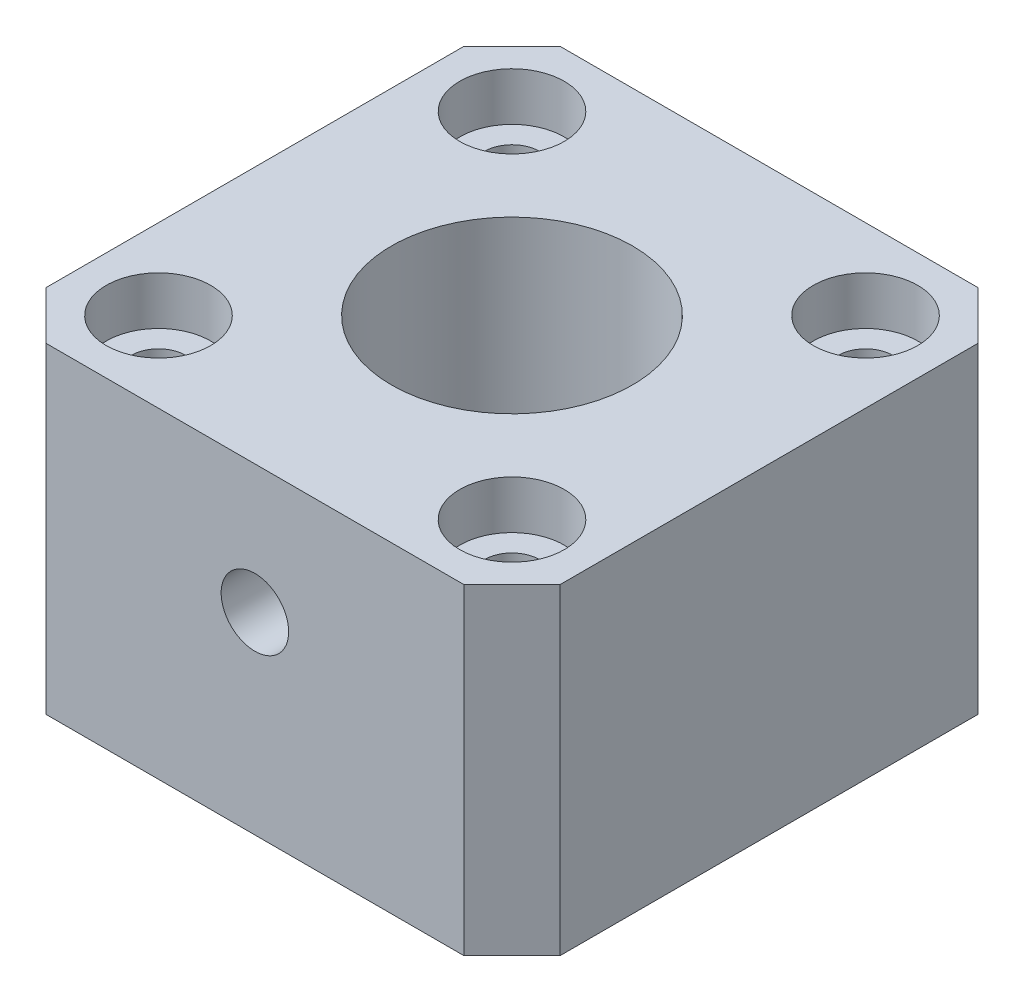
ISO-10303-21;
HEADER;
FILE_DESCRIPTION(('STEP AP214'),'2;1');
FILE_NAME('part.step','',(''),(''),'','','');
FILE_SCHEMA(('AUTOMOTIVE_DESIGN { 1 0 10303 214 1 1 1 1 }'));
ENDSEC;
DATA;
#1=APPLICATION_CONTEXT('core data for automotive mechanical design processes');
#2=APPLICATION_PROTOCOL_DEFINITION('international standard','automotive_design',2000,#1);
#3=PRODUCT_CONTEXT('',#1,'mechanical');
#4=PRODUCT('Part','Part','',(#3));
#5=PRODUCT_RELATED_PRODUCT_CATEGORY('part','',(#4));
#6=PRODUCT_DEFINITION_FORMATION('','',#4);
#7=PRODUCT_DEFINITION_CONTEXT('part definition',#1,'design');
#8=PRODUCT_DEFINITION('design','',#6,#7);
#9=PRODUCT_DEFINITION_SHAPE('','',#8);
#10=(LENGTH_UNIT() NAMED_UNIT(*) SI_UNIT(.MILLI.,.METRE.));
#11=(NAMED_UNIT(*) PLANE_ANGLE_UNIT() SI_UNIT($,.RADIAN.));
#12=(NAMED_UNIT(*) SI_UNIT($,.STERADIAN.) SOLID_ANGLE_UNIT());
#13=UNCERTAINTY_MEASURE_WITH_UNIT(LENGTH_MEASURE(1.E-05),#10,'distance_accuracy_value','');
#14=(GEOMETRIC_REPRESENTATION_CONTEXT(3) GLOBAL_UNCERTAINTY_ASSIGNED_CONTEXT((#13)) GLOBAL_UNIT_ASSIGNED_CONTEXT((#10,
#11,#12)) REPRESENTATION_CONTEXT('',''));
#15=CARTESIAN_POINT('',(0.,0.,0.));
#16=DIRECTION('',(0.,0.,1.));
#17=DIRECTION('',(1.,0.,0.));
#18=AXIS2_PLACEMENT_3D('',#15,#16,#17);
#19=CARTESIAN_POINT('',(0.,20.,0.));
#20=DIRECTION('',(0.,1.,0.));
#21=DIRECTION('',(0.,0.,1.));
#22=AXIS2_PLACEMENT_3D('',#19,#20,#21);
#23=PLANE('',#22);
#24=CARTESIAN_POINT('',(-11.,20.,-11.));
#25=DIRECTION('',(0.,1.,0.));
#26=DIRECTION('',(0.,0.,1.));
#27=AXIS2_PLACEMENT_3D('',#24,#25,#26);
#28=CIRCLE('',#27,3.25);
#29=CARTESIAN_POINT('',(-11.,20.,-7.75));
#30=VERTEX_POINT('',#29);
#31=EDGE_CURVE('E248',#30,#30,#28,.T.);
#32=ORIENTED_EDGE('',*,*,#31,.F.);
#33=EDGE_LOOP('',(#32));
#34=FACE_BOUND('',#33,.T.);
#35=CARTESIAN_POINT('',(11.,20.,-11.));
#36=DIRECTION('',(0.,1.,0.));
#37=DIRECTION('',(0.,0.,1.));
#38=AXIS2_PLACEMENT_3D('',#35,#36,#37);
#39=CIRCLE('',#38,3.25);
#40=CARTESIAN_POINT('',(11.,20.,-7.75));
#41=VERTEX_POINT('',#40);
#42=EDGE_CURVE('E236',#41,#41,#39,.T.);
#43=ORIENTED_EDGE('',*,*,#42,.F.);
#44=EDGE_LOOP('',(#43));
#45=FACE_BOUND('',#44,.T.);
#46=CARTESIAN_POINT('',(11.,20.,11.));
#47=DIRECTION('',(0.,1.,0.));
#48=DIRECTION('',(0.,0.,1.));
#49=AXIS2_PLACEMENT_3D('',#46,#47,#48);
#50=CIRCLE('',#49,3.25);
#51=CARTESIAN_POINT('',(11.,20.,14.25));
#52=VERTEX_POINT('',#51);
#53=EDGE_CURVE('E224',#52,#52,#50,.T.);
#54=ORIENTED_EDGE('',*,*,#53,.F.);
#55=EDGE_LOOP('',(#54));
#56=FACE_BOUND('',#55,.T.);
#57=CARTESIAN_POINT('',(-11.,20.,11.));
#58=DIRECTION('',(0.,1.,0.));
#59=DIRECTION('',(0.,0.,1.));
#60=AXIS2_PLACEMENT_3D('',#57,#58,#59);
#61=CIRCLE('',#60,3.25);
#62=CARTESIAN_POINT('',(-11.,20.,14.25));
#63=VERTEX_POINT('',#62);
#64=EDGE_CURVE('E212',#63,#63,#61,.T.);
#65=ORIENTED_EDGE('',*,*,#64,.F.);
#66=EDGE_LOOP('',(#65));
#67=FACE_BOUND('',#66,.T.);
#68=DIRECTION('',(1.,0.,0.));
#69=VECTOR('',#68,1.);
#70=CARTESIAN_POINT('',(15.9999999999999,20.,15.9999999999999));
#71=LINE('',#70,#69);
#72=CARTESIAN_POINT('',(-12.9999999999999,20.,15.9999999999999));
#73=VERTEX_POINT('',#72);
#74=CARTESIAN_POINT('',(12.9999999999999,20.,15.9999999999999));
#75=VERTEX_POINT('',#74);
#76=EDGE_CURVE('E187',#73,#75,#71,.T.);
#77=ORIENTED_EDGE('',*,*,#76,.T.);
#78=DIRECTION('',(-0.707106781186548,0.,0.707106781186547));
#79=VECTOR('',#78,1.);
#80=CARTESIAN_POINT('',(14.4999999999999,20.,14.5));
#81=LINE('',#80,#79);
#82=CARTESIAN_POINT('',(15.9999999999999,20.,12.9999999999999));
#83=VERTEX_POINT('',#82);
#84=EDGE_CURVE('E167',#75,#83,#81,.F.);
#85=ORIENTED_EDGE('',*,*,#84,.T.);
#86=DIRECTION('',(0.,0.,-1.));
#87=VECTOR('',#86,1.);
#88=CARTESIAN_POINT('',(15.9999999999999,20.,15.9999999999999));
#89=LINE('',#88,#87);
#90=CARTESIAN_POINT('',(15.9999999999999,20.,-12.9999999999999));
#91=VERTEX_POINT('',#90);
#92=EDGE_CURVE('E137',#83,#91,#89,.T.);
#93=ORIENTED_EDGE('',*,*,#92,.T.);
#94=DIRECTION('',(0.707106781186547,0.,0.707106781186548));
#95=VECTOR('',#94,1.);
#96=CARTESIAN_POINT('',(14.5,20.,-14.4999999999999));
#97=LINE('',#96,#95);
#98=CARTESIAN_POINT('',(12.9999999999999,20.,-15.9999999999999));
#99=VERTEX_POINT('',#98);
#100=EDGE_CURVE('E73',#91,#99,#97,.F.);
#101=ORIENTED_EDGE('',*,*,#100,.T.);
#102=DIRECTION('',(-1.,0.,0.));
#103=VECTOR('',#102,1.);
#104=CARTESIAN_POINT('',(15.9999999999999,20.,-15.9999999999999));
#105=LINE('',#104,#103);
#106=CARTESIAN_POINT('',(-12.9999999999999,20.,-15.9999999999999));
#107=VERTEX_POINT('',#106);
#108=EDGE_CURVE('E154',#99,#107,#105,.T.);
#109=ORIENTED_EDGE('',*,*,#108,.T.);
#110=DIRECTION('',(0.707106781186548,0.,-0.707106781186547));
#111=VECTOR('',#110,1.);
#112=CARTESIAN_POINT('',(-14.4999999999999,20.,-14.5));
#113=LINE('',#112,#111);
#114=CARTESIAN_POINT('',(-15.9999999999999,20.,-12.9999999999999));
#115=VERTEX_POINT('',#114);
#116=EDGE_CURVE('E162',#107,#115,#113,.F.);
#117=ORIENTED_EDGE('',*,*,#116,.T.);
#118=DIRECTION('',(0.,0.,1.));
#119=VECTOR('',#118,1.);
#120=CARTESIAN_POINT('',(-15.9999999999999,20.,15.9999999999999));
#121=LINE('',#120,#119);
#122=CARTESIAN_POINT('',(-15.9999999999999,20.,12.9999999999999));
#123=VERTEX_POINT('',#122);
#124=EDGE_CURVE('E148',#115,#123,#121,.T.);
#125=ORIENTED_EDGE('',*,*,#124,.T.);
#126=DIRECTION('',(-0.707106781186547,0.,-0.707106781186548));
#127=VECTOR('',#126,1.);
#128=CARTESIAN_POINT('',(-14.5,20.,14.4999999999999));
#129=LINE('',#128,#127);
#130=EDGE_CURVE('E165',#123,#73,#129,.F.);
#131=ORIENTED_EDGE('',*,*,#130,.T.);
#132=EDGE_LOOP('',(#77,#85,#93,#101,#109,#117,#125,#131));
#133=FACE_BOUND('',#132,.T.);
#134=CARTESIAN_POINT('',(0.,20.,0.));
#135=DIRECTION('',(0.,1.,0.));
#136=DIRECTION('',(0.,0.,1.));
#137=AXIS2_PLACEMENT_3D('',#134,#135,#136);
#138=CIRCLE('',#137,7.5);
#139=CARTESIAN_POINT('',(0.,20.,7.5));
#140=VERTEX_POINT('',#139);
#141=EDGE_CURVE('E193',#140,#140,#138,.T.);
#142=ORIENTED_EDGE('',*,*,#141,.F.);
#143=EDGE_LOOP('',(#142));
#144=FACE_BOUND('',#143,.T.);
#145=ADVANCED_FACE('F51',(#34,#45,#56,#67,#133,#144),#23,.T.);
#146=CARTESIAN_POINT('',(0.,0.,0.));
#147=DIRECTION('',(0.,1.,0.));
#148=DIRECTION('',(0.,0.,1.));
#149=AXIS2_PLACEMENT_3D('',#146,#147,#148);
#150=PLANE('',#149);
#151=CARTESIAN_POINT('',(-11.,0.,-11.));
#152=DIRECTION('',(0.,1.,0.));
#153=DIRECTION('',(0.,0.,1.));
#154=AXIS2_PLACEMENT_3D('',#151,#152,#153);
#155=CIRCLE('',#154,1.69999999999999);
#156=CARTESIAN_POINT('',(-11.,0.,-9.30000000000001));
#157=VERTEX_POINT('',#156);
#158=EDGE_CURVE('E239',#157,#157,#155,.T.);
#159=ORIENTED_EDGE('',*,*,#158,.T.);
#160=EDGE_LOOP('',(#159));
#161=FACE_BOUND('',#160,.T.);
#162=CARTESIAN_POINT('',(11.,0.,-11.));
#163=DIRECTION('',(0.,1.,0.));
#164=DIRECTION('',(0.,0.,1.));
#165=AXIS2_PLACEMENT_3D('',#162,#163,#164);
#166=CIRCLE('',#165,1.69999999999999);
#167=CARTESIAN_POINT('',(11.,0.,-9.3));
#168=VERTEX_POINT('',#167);
#169=EDGE_CURVE('E227',#168,#168,#166,.T.);
#170=ORIENTED_EDGE('',*,*,#169,.T.);
#171=EDGE_LOOP('',(#170));
#172=FACE_BOUND('',#171,.T.);
#173=CARTESIAN_POINT('',(11.,0.,11.));
#174=DIRECTION('',(0.,1.,0.));
#175=DIRECTION('',(0.,0.,1.));
#176=AXIS2_PLACEMENT_3D('',#173,#174,#175);
#177=CIRCLE('',#176,1.69999999999999);
#178=CARTESIAN_POINT('',(11.,0.,12.7));
#179=VERTEX_POINT('',#178);
#180=EDGE_CURVE('E215',#179,#179,#177,.T.);
#181=ORIENTED_EDGE('',*,*,#180,.T.);
#182=EDGE_LOOP('',(#181));
#183=FACE_BOUND('',#182,.T.);
#184=CARTESIAN_POINT('',(-11.,0.,11.));
#185=DIRECTION('',(0.,1.,0.));
#186=DIRECTION('',(0.,0.,1.));
#187=AXIS2_PLACEMENT_3D('',#184,#185,#186);
#188=CIRCLE('',#187,1.69999999999999);
#189=CARTESIAN_POINT('',(-11.,0.,12.7));
#190=VERTEX_POINT('',#189);
#191=EDGE_CURVE('E202',#190,#190,#188,.T.);
#192=ORIENTED_EDGE('',*,*,#191,.T.);
#193=EDGE_LOOP('',(#192));
#194=FACE_BOUND('',#193,.T.);
#195=DIRECTION('',(0.,0.,-1.));
#196=VECTOR('',#195,1.);
#197=CARTESIAN_POINT('',(15.9999999999999,0.,15.9999999999999));
#198=LINE('',#197,#196);
#199=CARTESIAN_POINT('',(15.9999999999999,0.,12.9999999999999));
#200=VERTEX_POINT('',#199);
#201=CARTESIAN_POINT('',(15.9999999999999,0.,-12.9999999999999));
#202=VERTEX_POINT('',#201);
#203=EDGE_CURVE('E135',#200,#202,#198,.T.);
#204=ORIENTED_EDGE('',*,*,#203,.F.);
#205=DIRECTION('',(0.707106781186548,0.,-0.707106781186547));
#206=VECTOR('',#205,1.);
#207=CARTESIAN_POINT('',(15.9999999999999,0.,12.9999999999999));
#208=LINE('',#207,#206);
#209=CARTESIAN_POINT('',(12.9999999999999,0.,15.9999999999999));
#210=VERTEX_POINT('',#209);
#211=EDGE_CURVE('E118',#200,#210,#208,.F.);
#212=ORIENTED_EDGE('',*,*,#211,.T.);
#213=DIRECTION('',(1.,0.,0.));
#214=VECTOR('',#213,1.);
#215=CARTESIAN_POINT('',(15.9999999999999,0.,15.9999999999999));
#216=LINE('',#215,#214);
#217=CARTESIAN_POINT('',(-12.9999999999999,0.,15.9999999999999));
#218=VERTEX_POINT('',#217);
#219=EDGE_CURVE('E146',#218,#210,#216,.T.);
#220=ORIENTED_EDGE('',*,*,#219,.F.);
#221=DIRECTION('',(0.707106781186547,0.,0.707106781186548));
#222=VECTOR('',#221,1.);
#223=CARTESIAN_POINT('',(-12.9999999999999,0.,15.9999999999999));
#224=LINE('',#223,#222);
#225=CARTESIAN_POINT('',(-15.9999999999999,0.,12.9999999999999));
#226=VERTEX_POINT('',#225);
#227=EDGE_CURVE('E129',#218,#226,#224,.F.);
#228=ORIENTED_EDGE('',*,*,#227,.T.);
#229=DIRECTION('',(0.,0.,1.));
#230=VECTOR('',#229,1.);
#231=CARTESIAN_POINT('',(-15.9999999999999,0.,15.9999999999999));
#232=LINE('',#231,#230);
#233=CARTESIAN_POINT('',(-15.9999999999999,0.,-12.9999999999999));
#234=VERTEX_POINT('',#233);
#235=EDGE_CURVE('E150',#234,#226,#232,.T.);
#236=ORIENTED_EDGE('',*,*,#235,.F.);
#237=DIRECTION('',(-0.707106781186548,0.,0.707106781186547));
#238=VECTOR('',#237,1.);
#239=CARTESIAN_POINT('',(-15.9999999999999,0.,-12.9999999999999));
#240=LINE('',#239,#238);
#241=CARTESIAN_POINT('',(-12.9999999999999,0.,-15.9999999999999));
#242=VERTEX_POINT('',#241);
#243=EDGE_CURVE('E138',#234,#242,#240,.F.);
#244=ORIENTED_EDGE('',*,*,#243,.T.);
#245=DIRECTION('',(-1.,0.,0.));
#246=VECTOR('',#245,1.);
#247=CARTESIAN_POINT('',(15.9999999999999,0.,-15.9999999999999));
#248=LINE('',#247,#246);
#249=CARTESIAN_POINT('',(12.9999999999999,0.,-15.9999999999999));
#250=VERTEX_POINT('',#249);
#251=EDGE_CURVE('E145',#250,#242,#248,.T.);
#252=ORIENTED_EDGE('',*,*,#251,.F.);
#253=DIRECTION('',(-0.707106781186547,0.,-0.707106781186548));
#254=VECTOR('',#253,1.);
#255=CARTESIAN_POINT('',(12.9999999999999,0.,-15.9999999999999));
#256=LINE('',#255,#254);
#257=EDGE_CURVE('E144',#250,#202,#256,.F.);
#258=ORIENTED_EDGE('',*,*,#257,.T.);
#259=EDGE_LOOP('',(#204,#212,#220,#228,#236,#244,#252,#258));
#260=FACE_BOUND('',#259,.T.);
#261=CARTESIAN_POINT('',(0.,0.,0.));
#262=DIRECTION('',(0.,1.,0.));
#263=DIRECTION('',(0.,0.,1.));
#264=AXIS2_PLACEMENT_3D('',#261,#262,#263);
#265=CIRCLE('',#264,7.5);
#266=CARTESIAN_POINT('',(0.,0.,7.5));
#267=VERTEX_POINT('',#266);
#268=EDGE_CURVE('E195',#267,#267,#265,.T.);
#269=ORIENTED_EDGE('',*,*,#268,.T.);
#270=EDGE_LOOP('',(#269));
#271=FACE_BOUND('',#270,.T.);
#272=ADVANCED_FACE('F141',(#161,#172,#183,#194,#260,#271),#150,.F.);
#273=CARTESIAN_POINT('',(-15.9999999999999,20.,15.9999999999999));
#274=DIRECTION('',(1.,0.,0.));
#275=DIRECTION('',(0.,0.,-1.));
#276=AXIS2_PLACEMENT_3D('',#273,#274,#275);
#277=PLANE('',#276);
#278=ORIENTED_EDGE('',*,*,#235,.T.);
#279=DIRECTION('',(0.,1.,0.));
#280=VECTOR('',#279,1.);
#281=CARTESIAN_POINT('',(-15.9999999999999,20.,12.9999999999999));
#282=LINE('',#281,#280);
#283=EDGE_CURVE('E172',#226,#123,#282,.T.);
#284=ORIENTED_EDGE('',*,*,#283,.T.);
#285=ORIENTED_EDGE('',*,*,#124,.F.);
#286=DIRECTION('',(0.,-1.,0.));
#287=VECTOR('',#286,1.);
#288=CARTESIAN_POINT('',(-15.9999999999999,20.,-12.9999999999999));
#289=LINE('',#288,#287);
#290=EDGE_CURVE('E169',#115,#234,#289,.T.);
#291=ORIENTED_EDGE('',*,*,#290,.T.);
#292=EDGE_LOOP('',(#278,#284,#285,#291));
#293=FACE_BOUND('',#292,.T.);
#294=ADVANCED_FACE('F178',(#293),#277,.F.);
#295=CARTESIAN_POINT('',(15.9999999999999,20.,15.9999999999999));
#296=DIRECTION('',(0.,0.,-1.));
#297=DIRECTION('',(-1.,0.,0.));
#298=AXIS2_PLACEMENT_3D('',#295,#296,#297);
#299=PLANE('',#298);
#300=CARTESIAN_POINT('',(0.,12.,15.9999999999999));
#301=DIRECTION('',(0.,0.,1.));
#302=DIRECTION('',(1.,0.,0.));
#303=AXIS2_PLACEMENT_3D('',#300,#301,#302);
#304=CIRCLE('',#303,2.1);
#305=CARTESIAN_POINT('',(2.1,12.,15.9999999999999));
#306=VERTEX_POINT('',#305);
#307=EDGE_CURVE('E259',#306,#306,#304,.T.);
#308=ORIENTED_EDGE('',*,*,#307,.F.);
#309=EDGE_LOOP('',(#308));
#310=FACE_BOUND('',#309,.T.);
#311=ORIENTED_EDGE('',*,*,#219,.T.);
#312=DIRECTION('',(0.,1.,0.));
#313=VECTOR('',#312,1.);
#314=CARTESIAN_POINT('',(12.9999999999999,20.,15.9999999999999));
#315=LINE('',#314,#313);
#316=EDGE_CURVE('E123',#210,#75,#315,.T.);
#317=ORIENTED_EDGE('',*,*,#316,.T.);
#318=ORIENTED_EDGE('',*,*,#76,.F.);
#319=DIRECTION('',(0.,-1.,0.));
#320=VECTOR('',#319,1.);
#321=CARTESIAN_POINT('',(-12.9999999999999,20.,15.9999999999999));
#322=LINE('',#321,#320);
#323=EDGE_CURVE('E128',#73,#218,#322,.T.);
#324=ORIENTED_EDGE('',*,*,#323,.T.);
#325=EDGE_LOOP('',(#311,#317,#318,#324));
#326=FACE_BOUND('',#325,.T.);
#327=ADVANCED_FACE('F192',(#310,#326),#299,.F.);
#328=CARTESIAN_POINT('',(15.9999999999999,20.,15.9999999999999));
#329=DIRECTION('',(-1.,0.,0.));
#330=DIRECTION('',(0.,0.,1.));
#331=AXIS2_PLACEMENT_3D('',#328,#329,#330);
#332=PLANE('',#331);
#333=ORIENTED_EDGE('',*,*,#92,.F.);
#334=DIRECTION('',(0.,-1.,0.));
#335=VECTOR('',#334,1.);
#336=CARTESIAN_POINT('',(15.9999999999999,20.,12.9999999999999));
#337=LINE('',#336,#335);
#338=EDGE_CURVE('E122',#83,#200,#337,.T.);
#339=ORIENTED_EDGE('',*,*,#338,.T.);
#340=ORIENTED_EDGE('',*,*,#203,.T.);
#341=DIRECTION('',(0.,1.,0.));
#342=VECTOR('',#341,1.);
#343=CARTESIAN_POINT('',(15.9999999999999,20.,-12.9999999999999));
#344=LINE('',#343,#342);
#345=EDGE_CURVE('E139',#202,#91,#344,.T.);
#346=ORIENTED_EDGE('',*,*,#345,.T.);
#347=EDGE_LOOP('',(#333,#339,#340,#346));
#348=FACE_BOUND('',#347,.T.);
#349=ADVANCED_FACE('F134',(#348),#332,.F.);
#350=CARTESIAN_POINT('',(15.9999999999999,20.,-15.9999999999999));
#351=DIRECTION('',(0.,0.,1.));
#352=DIRECTION('',(1.,0.,0.));
#353=AXIS2_PLACEMENT_3D('',#350,#351,#352);
#354=PLANE('',#353);
#355=ORIENTED_EDGE('',*,*,#108,.F.);
#356=DIRECTION('',(0.,-1.,0.));
#357=VECTOR('',#356,1.);
#358=CARTESIAN_POINT('',(12.9999999999999,20.,-15.9999999999999));
#359=LINE('',#358,#357);
#360=EDGE_CURVE('E11',#99,#250,#359,.T.);
#361=ORIENTED_EDGE('',*,*,#360,.T.);
#362=ORIENTED_EDGE('',*,*,#251,.T.);
#363=DIRECTION('',(0.,1.,0.));
#364=VECTOR('',#363,1.);
#365=CARTESIAN_POINT('',(-12.9999999999999,20.,-15.9999999999999));
#366=LINE('',#365,#364);
#367=EDGE_CURVE('E60',#242,#107,#366,.T.);
#368=ORIENTED_EDGE('',*,*,#367,.T.);
#369=EDGE_LOOP('',(#355,#361,#362,#368));
#370=FACE_BOUND('',#369,.T.);
#371=ADVANCED_FACE('F291',(#370),#354,.F.);
#372=CARTESIAN_POINT('',(0.,20.,0.));
#373=DIRECTION('',(0.,-1.,0.));
#374=DIRECTION('',(0.,0.,-1.));
#375=AXIS2_PLACEMENT_3D('',#372,#373,#374);
#376=CYLINDRICAL_SURFACE('',#375,7.5);
#377=CARTESIAN_POINT('',(2.1,12.,7.2));
#378=CARTESIAN_POINT('',(2.09999769142372,11.8845511051713,7.20000175092611));
#379=CARTESIAN_POINT('',(2.09044725800801,11.7690785753207,7.20280713265303));
#380=CARTESIAN_POINT('',(2.05258019102825,11.5414842875502,7.21368770991474));
#381=CARTESIAN_POINT('',(2.02425538445371,11.4293640111861,7.22176520052276));
#382=CARTESIAN_POINT('',(1.94985652031882,11.2118002398836,7.24220502233453));
#383=CARTESIAN_POINT('',(1.90380916683966,11.1063469761871,7.25456090412264));
#384=CARTESIAN_POINT('',(1.79535769220004,10.9046420760665,7.28215690109494));
#385=CARTESIAN_POINT('',(1.73295183131605,10.8083914198242,7.29739732300137));
#386=CARTESIAN_POINT('',(1.59171413202466,10.6251705241638,7.32951618449187));
#387=CARTESIAN_POINT('',(1.51251149606312,10.5384915540778,7.34642599336529));
#388=CARTESIAN_POINT('',(1.34072490285876,10.3794568479917,7.3797086675302));
#389=CARTESIAN_POINT('',(1.24813943745967,10.3071027284882,7.39608147204938));
#390=CARTESIAN_POINT('',(1.05017536418181,10.177537651625,7.42679785762245));
#391=CARTESIAN_POINT('',(0.944598390212247,10.1206191353902,7.44110013563313));
#392=CARTESIAN_POINT('',(0.724904746771355,10.0254530917685,7.46570231446394));
#393=CARTESIAN_POINT('',(0.610789675797228,9.98720207950076,7.4760029622418));
#394=CARTESIAN_POINT('',(0.380302236373029,9.93140772474192,7.49121941354851));
#395=CARTESIAN_POINT('',(0.264058623362758,9.91336823938435,7.49626401123117));
#396=CARTESIAN_POINT('',(0.0300927460088113,9.89694502126617,7.50085154395726));
#397=CARTESIAN_POINT('',(-0.0876292425050762,9.89855767475153,7.50039549049382));
#398=CARTESIAN_POINT('',(-0.317746311518628,9.92104988331973,7.49412619131461));
#399=CARTESIAN_POINT('',(-0.430198522887029,9.94139293966687,7.48846212582118));
#400=CARTESIAN_POINT('',(-0.650024177765253,9.99989803930804,7.47259127690994));
#401=CARTESIAN_POINT('',(-0.75739731735417,10.0380611474346,7.4623842220287));
#402=CARTESIAN_POINT('',(-0.965349801263519,10.1315153935555,7.43835884069074));
#403=CARTESIAN_POINT('',(-1.06584470618675,10.1869844493054,7.42450324668395));
#404=CARTESIAN_POINT('',(-1.25627862457918,10.3133379599375,7.39466485562083));
#405=CARTESIAN_POINT('',(-1.34621539544035,10.3842256807433,7.37868160817165));
#406=CARTESIAN_POINT('',(-1.51618305590153,10.5422275435535,7.34567522057906));
#407=CARTESIAN_POINT('',(-1.59577717509012,10.6298085841034,7.32863518998309));
#408=CARTESIAN_POINT('',(-1.73926156835205,10.817248686452,7.29591665217892));
#409=CARTESIAN_POINT('',(-1.80315067068666,10.917108663539,7.28023824661686));
#410=CARTESIAN_POINT('',(-1.91379030231589,11.127296669996,7.25194501002577));
#411=CARTESIAN_POINT('',(-1.96041048527215,11.2376967057216,7.23935371206725));
#412=CARTESIAN_POINT('',(-2.03427979371573,11.465210552784,7.21894665875122));
#413=CARTESIAN_POINT('',(-2.06153429654469,11.5823224906332,7.21112957780356));
#414=CARTESIAN_POINT('',(-2.09512133703559,11.8158226539633,7.20144181427927));
#415=CARTESIAN_POINT('',(-2.10211023295226,11.93210882732,7.19938465899453));
#416=CARTESIAN_POINT('',(-2.09678562260948,12.1641906790211,7.20093733719562));
#417=CARTESIAN_POINT('',(-2.08447441367736,12.2799864140983,7.20454649620962));
#418=CARTESIAN_POINT('',(-2.04148011473316,12.5051921119612,7.21684386770043));
#419=CARTESIAN_POINT('',(-2.01120230768185,12.6146861774371,7.22541993924817));
#420=CARTESIAN_POINT('',(-1.93359543214541,12.827038759286,7.24657269498035));
#421=CARTESIAN_POINT('',(-1.88626397295672,12.9298963429243,7.25914994004911));
#422=CARTESIAN_POINT('',(-1.77459509136294,13.1287726976177,7.28726240690147));
#423=CARTESIAN_POINT('',(-1.70987813502039,13.224569166007,7.30286116048027));
#424=CARTESIAN_POINT('',(-1.56573803326782,13.4041831464385,7.33511474861878));
#425=CARTESIAN_POINT('',(-1.48631183008104,13.48799816133,7.35176980228926));
#426=CARTESIAN_POINT('',(-1.31195238316687,13.6440508365738,7.38490975407121));
#427=CARTESIAN_POINT('',(-1.21660153256647,13.7158277694972,7.4013718288206));
#428=CARTESIAN_POINT('',(-1.01482822512431,13.8423629556993,7.43172364179825));
#429=CARTESIAN_POINT('',(-0.908406353625253,13.8971221081257,7.44561351591507));
#430=CARTESIAN_POINT('',(-0.688255620931218,13.9875492351142,7.46916678636433));
#431=CARTESIAN_POINT('',(-0.574589642969954,14.0233615963978,7.47886204186584));
#432=CARTESIAN_POINT('',(-0.342537614831907,14.0752817885412,7.4930742926061));
#433=CARTESIAN_POINT('',(-0.224152734238768,14.0913944710087,7.49759256280785));
#434=CARTESIAN_POINT('',(0.00969112124072433,14.10312839472,7.50087475153958));
#435=CARTESIAN_POINT('',(0.12511414497101,14.0994223040454,7.49982757425403));
#436=CARTESIAN_POINT('',(0.35362688103667,14.0732036113851,7.49253071356722));
#437=CARTESIAN_POINT('',(0.46671669725485,14.0506918485554,7.48628126230442));
#438=CARTESIAN_POINT('',(0.686456269375142,13.9878961395834,7.46932613881606));
#439=CARTESIAN_POINT('',(0.793151611784456,13.947760954317,7.4586578085919));
#440=CARTESIAN_POINT('',(0.998353701041718,13.8509899871999,7.43397489084363));
#441=CARTESIAN_POINT('',(1.09685921135807,13.7943517194461,7.41995979924538));
#442=CARTESIAN_POINT('',(1.28596610763476,13.6642830017714,7.38956927564246));
#443=CARTESIAN_POINT('',(1.37625788128737,13.5904156469499,7.37313745973981));
#444=CARTESIAN_POINT('',(1.54339107601341,13.4287978215395,7.3399740390093));
#445=CARTESIAN_POINT('',(1.6202288270092,13.341043575182,7.32324235374892));
#446=CARTESIAN_POINT('',(1.7601810081138,13.1515128777181,7.29088892650895));
#447=CARTESIAN_POINT('',(1.82290552428642,13.0494413726798,7.27530525828304));
#448=CARTESIAN_POINT('',(1.93021956053794,12.8357780087594,7.24757503896698));
#449=CARTESIAN_POINT('',(1.97481976673699,12.7241918068514,7.23542646383001));
#450=CARTESIAN_POINT('',(2.03947300884321,12.5110171503509,7.2174445712127));
#451=CARTESIAN_POINT('',(2.0621139131252,12.4102617611271,7.21095909202013));
#452=CARTESIAN_POINT('',(2.09237736458971,12.2063436429143,7.20223632826998));
#453=CARTESIAN_POINT('',(2.10000206326628,12.1031812609381,7.19999843512782));
#454=CARTESIAN_POINT('',(2.1,12.,7.2));
#455=B_SPLINE_CURVE_WITH_KNOTS('',3,(#377,#378,#379,#380,#381,#382,#383,#384,#385,#386,#387,
#388,#389,#390,#391,#392,#393,#394,#395,#396,#397,#398,#399,#400,#401,#402,#403,#404,#405,#406,
#407,#408,#409,#410,#411,#412,#413,#414,#415,#416,#417,#418,#419,#420,#421,#422,#423,#424,#425,
#426,#427,#428,#429,#430,#431,#432,#433,#434,#435,#436,#437,#438,#439,#440,#441,#442,#443,#444,
#445,#446,#447,#448,#449,#450,#451,#452,#453,#454),.UNSPECIFIED.,.T.,.F.,(4,2,2,2,2,2,2,2,2,2,2,
2,2,2,2,2,2,2,2,2,2,2,2,2,2,2,2,2,2,2,2,2,2,2,2,2,2,2,4),(0.,0.345966820679474,
0.692084349409678,1.03768238213021,1.3833171840449,1.73757082880146,2.09186442676818,
2.45246381411618,2.81299585839308,3.1644693582517,3.51587822801511,3.85752460211593,
4.19919139381877,4.54449343533439,4.88986868878041,5.24690042870957,5.60395879841149,
5.96365984094947,6.32326096486549,6.67107770948494,7.01885305597463,7.35906666926101,
7.69932799470604,8.0477245112009,8.39619353426625,8.75590447674839,9.11559641039041,
9.47250627059271,9.82932821384833,10.1741178008124,10.5188920032276,10.8608102624592,
11.202780052397,11.5546053491271,11.9065264700836,12.2672217164641,12.627703986753,
12.9369525819905,13.2461568654393),.UNSPECIFIED.);
#456=CARTESIAN_POINT('',(2.1,12.,7.2));
#457=VERTEX_POINT('',#456);
#458=EDGE_CURVE('E251',#457,#457,#455,.T.);
#459=ORIENTED_EDGE('',*,*,#458,.F.);
#460=EDGE_LOOP('',(#459));
#461=FACE_BOUND('',#460,.T.);
#462=ORIENTED_EDGE('',*,*,#141,.T.);
#463=EDGE_LOOP('',(#462));
#464=FACE_BOUND('',#463,.T.);
#465=ORIENTED_EDGE('',*,*,#268,.F.);
#466=EDGE_LOOP('',(#465));
#467=FACE_BOUND('',#466,.T.);
#468=ADVANCED_FACE('F288',(#461,#464,#467),#376,.F.);
#469=CARTESIAN_POINT('',(-11.,20.,11.));
#470=DIRECTION('',(0.,1.,0.));
#471=DIRECTION('',(0.,0.,1.));
#472=AXIS2_PLACEMENT_3D('',#469,#470,#471);
#473=CYLINDRICAL_SURFACE('',#472,1.7);
#474=ORIENTED_EDGE('',*,*,#191,.F.);
#475=EDGE_LOOP('',(#474));
#476=FACE_BOUND('',#475,.T.);
#477=CARTESIAN_POINT('',(-11.,17.,11.));
#478=DIRECTION('',(0.,1.,0.));
#479=DIRECTION('',(0.,0.,1.));
#480=AXIS2_PLACEMENT_3D('',#477,#478,#479);
#481=CIRCLE('',#480,1.7);
#482=CARTESIAN_POINT('',(-11.,17.,12.7));
#483=VERTEX_POINT('',#482);
#484=EDGE_CURVE('E206',#483,#483,#481,.T.);
#485=ORIENTED_EDGE('',*,*,#484,.T.);
#486=EDGE_LOOP('',(#485));
#487=FACE_BOUND('',#486,.T.);
#488=ADVANCED_FACE('F451',(#476,#487),#473,.F.);
#489=CARTESIAN_POINT('',(-9.3,17.,11.));
#490=DIRECTION('',(0.,-1.,0.));
#491=DIRECTION('',(0.,0.,-1.));
#492=AXIS2_PLACEMENT_3D('',#489,#490,#491);
#493=PLANE('',#492);
#494=ORIENTED_EDGE('',*,*,#484,.F.);
#495=EDGE_LOOP('',(#494));
#496=FACE_BOUND('',#495,.T.);
#497=CARTESIAN_POINT('',(-11.,17.,11.));
#498=DIRECTION('',(0.,1.,0.));
#499=DIRECTION('',(0.,0.,1.));
#500=AXIS2_PLACEMENT_3D('',#497,#498,#499);
#501=CIRCLE('',#500,3.25);
#502=CARTESIAN_POINT('',(-11.,17.,14.25));
#503=VERTEX_POINT('',#502);
#504=EDGE_CURVE('E209',#503,#503,#501,.T.);
#505=ORIENTED_EDGE('',*,*,#504,.T.);
#506=EDGE_LOOP('',(#505));
#507=FACE_BOUND('',#506,.T.);
#508=ADVANCED_FACE('F441',(#496,#507),#493,.F.);
#509=CARTESIAN_POINT('',(-11.,20.,11.));
#510=DIRECTION('',(0.,1.,0.));
#511=DIRECTION('',(0.,0.,1.));
#512=AXIS2_PLACEMENT_3D('',#509,#510,#511);
#513=CYLINDRICAL_SURFACE('',#512,3.25);
#514=ORIENTED_EDGE('',*,*,#504,.F.);
#515=EDGE_LOOP('',(#514));
#516=FACE_BOUND('',#515,.T.);
#517=ORIENTED_EDGE('',*,*,#64,.T.);
#518=EDGE_LOOP('',(#517));
#519=FACE_BOUND('',#518,.T.);
#520=ADVANCED_FACE('F431',(#516,#519),#513,.F.);
#521=CARTESIAN_POINT('',(11.,20.,11.));
#522=DIRECTION('',(0.,1.,0.));
#523=DIRECTION('',(0.,0.,1.));
#524=AXIS2_PLACEMENT_3D('',#521,#522,#523);
#525=CYLINDRICAL_SURFACE('',#524,1.7);
#526=ORIENTED_EDGE('',*,*,#180,.F.);
#527=EDGE_LOOP('',(#526));
#528=FACE_BOUND('',#527,.T.);
#529=CARTESIAN_POINT('',(11.,17.,11.));
#530=DIRECTION('',(0.,1.,0.));
#531=DIRECTION('',(0.,0.,1.));
#532=AXIS2_PLACEMENT_3D('',#529,#530,#531);
#533=CIRCLE('',#532,1.7);
#534=CARTESIAN_POINT('',(11.,17.,12.7));
#535=VERTEX_POINT('',#534);
#536=EDGE_CURVE('E218',#535,#535,#533,.T.);
#537=ORIENTED_EDGE('',*,*,#536,.T.);
#538=EDGE_LOOP('',(#537));
#539=FACE_BOUND('',#538,.T.);
#540=ADVANCED_FACE('F421',(#528,#539),#525,.F.);
#541=CARTESIAN_POINT('',(12.7,17.,11.));
#542=DIRECTION('',(0.,-1.,0.));
#543=DIRECTION('',(0.,0.,-1.));
#544=AXIS2_PLACEMENT_3D('',#541,#542,#543);
#545=PLANE('',#544);
#546=ORIENTED_EDGE('',*,*,#536,.F.);
#547=EDGE_LOOP('',(#546));
#548=FACE_BOUND('',#547,.T.);
#549=CARTESIAN_POINT('',(11.,17.,11.));
#550=DIRECTION('',(0.,1.,0.));
#551=DIRECTION('',(0.,0.,1.));
#552=AXIS2_PLACEMENT_3D('',#549,#550,#551);
#553=CIRCLE('',#552,3.25);
#554=CARTESIAN_POINT('',(11.,17.,14.25));
#555=VERTEX_POINT('',#554);
#556=EDGE_CURVE('E221',#555,#555,#553,.T.);
#557=ORIENTED_EDGE('',*,*,#556,.T.);
#558=EDGE_LOOP('',(#557));
#559=FACE_BOUND('',#558,.T.);
#560=ADVANCED_FACE('F411',(#548,#559),#545,.F.);
#561=CARTESIAN_POINT('',(11.,20.,11.));
#562=DIRECTION('',(0.,1.,0.));
#563=DIRECTION('',(0.,0.,1.));
#564=AXIS2_PLACEMENT_3D('',#561,#562,#563);
#565=CYLINDRICAL_SURFACE('',#564,3.25);
#566=ORIENTED_EDGE('',*,*,#556,.F.);
#567=EDGE_LOOP('',(#566));
#568=FACE_BOUND('',#567,.T.);
#569=ORIENTED_EDGE('',*,*,#53,.T.);
#570=EDGE_LOOP('',(#569));
#571=FACE_BOUND('',#570,.T.);
#572=ADVANCED_FACE('F401',(#568,#571),#565,.F.);
#573=CARTESIAN_POINT('',(11.,20.,-11.));
#574=DIRECTION('',(0.,1.,0.));
#575=DIRECTION('',(0.,0.,1.));
#576=AXIS2_PLACEMENT_3D('',#573,#574,#575);
#577=CYLINDRICAL_SURFACE('',#576,1.7);
#578=ORIENTED_EDGE('',*,*,#169,.F.);
#579=EDGE_LOOP('',(#578));
#580=FACE_BOUND('',#579,.T.);
#581=CARTESIAN_POINT('',(11.,17.,-11.));
#582=DIRECTION('',(0.,1.,0.));
#583=DIRECTION('',(0.,0.,1.));
#584=AXIS2_PLACEMENT_3D('',#581,#582,#583);
#585=CIRCLE('',#584,1.7);
#586=CARTESIAN_POINT('',(11.,17.,-9.3));
#587=VERTEX_POINT('',#586);
#588=EDGE_CURVE('E230',#587,#587,#585,.T.);
#589=ORIENTED_EDGE('',*,*,#588,.T.);
#590=EDGE_LOOP('',(#589));
#591=FACE_BOUND('',#590,.T.);
#592=ADVANCED_FACE('F391',(#580,#591),#577,.F.);
#593=CARTESIAN_POINT('',(12.7,17.,-11.));
#594=DIRECTION('',(0.,-1.,0.));
#595=DIRECTION('',(0.,0.,-1.));
#596=AXIS2_PLACEMENT_3D('',#593,#594,#595);
#597=PLANE('',#596);
#598=ORIENTED_EDGE('',*,*,#588,.F.);
#599=EDGE_LOOP('',(#598));
#600=FACE_BOUND('',#599,.T.);
#601=CARTESIAN_POINT('',(11.,17.,-11.));
#602=DIRECTION('',(0.,1.,0.));
#603=DIRECTION('',(0.,0.,1.));
#604=AXIS2_PLACEMENT_3D('',#601,#602,#603);
#605=CIRCLE('',#604,3.25);
#606=CARTESIAN_POINT('',(11.,17.,-7.75));
#607=VERTEX_POINT('',#606);
#608=EDGE_CURVE('E233',#607,#607,#605,.T.);
#609=ORIENTED_EDGE('',*,*,#608,.T.);
#610=EDGE_LOOP('',(#609));
#611=FACE_BOUND('',#610,.T.);
#612=ADVANCED_FACE('F381',(#600,#611),#597,.F.);
#613=CARTESIAN_POINT('',(11.,20.,-11.));
#614=DIRECTION('',(0.,1.,0.));
#615=DIRECTION('',(0.,0.,1.));
#616=AXIS2_PLACEMENT_3D('',#613,#614,#615);
#617=CYLINDRICAL_SURFACE('',#616,3.25);
#618=ORIENTED_EDGE('',*,*,#608,.F.);
#619=EDGE_LOOP('',(#618));
#620=FACE_BOUND('',#619,.T.);
#621=ORIENTED_EDGE('',*,*,#42,.T.);
#622=EDGE_LOOP('',(#621));
#623=FACE_BOUND('',#622,.T.);
#624=ADVANCED_FACE('F371',(#620,#623),#617,.F.);
#625=CARTESIAN_POINT('',(-11.,20.,-11.));
#626=DIRECTION('',(0.,1.,0.));
#627=DIRECTION('',(0.,0.,1.));
#628=AXIS2_PLACEMENT_3D('',#625,#626,#627);
#629=CYLINDRICAL_SURFACE('',#628,1.7);
#630=ORIENTED_EDGE('',*,*,#158,.F.);
#631=EDGE_LOOP('',(#630));
#632=FACE_BOUND('',#631,.T.);
#633=CARTESIAN_POINT('',(-11.,17.,-11.));
#634=DIRECTION('',(0.,1.,0.));
#635=DIRECTION('',(0.,0.,1.));
#636=AXIS2_PLACEMENT_3D('',#633,#634,#635);
#637=CIRCLE('',#636,1.7);
#638=CARTESIAN_POINT('',(-11.,17.,-9.3));
#639=VERTEX_POINT('',#638);
#640=EDGE_CURVE('E242',#639,#639,#637,.T.);
#641=ORIENTED_EDGE('',*,*,#640,.T.);
#642=EDGE_LOOP('',(#641));
#643=FACE_BOUND('',#642,.T.);
#644=ADVANCED_FACE('F361',(#632,#643),#629,.F.);
#645=CARTESIAN_POINT('',(-9.3,17.,-11.));
#646=DIRECTION('',(0.,-1.,0.));
#647=DIRECTION('',(0.,0.,-1.));
#648=AXIS2_PLACEMENT_3D('',#645,#646,#647);
#649=PLANE('',#648);
#650=ORIENTED_EDGE('',*,*,#640,.F.);
#651=EDGE_LOOP('',(#650));
#652=FACE_BOUND('',#651,.T.);
#653=CARTESIAN_POINT('',(-11.,17.,-11.));
#654=DIRECTION('',(0.,1.,0.));
#655=DIRECTION('',(0.,0.,1.));
#656=AXIS2_PLACEMENT_3D('',#653,#654,#655);
#657=CIRCLE('',#656,3.25);
#658=CARTESIAN_POINT('',(-11.,17.,-7.75));
#659=VERTEX_POINT('',#658);
#660=EDGE_CURVE('E245',#659,#659,#657,.T.);
#661=ORIENTED_EDGE('',*,*,#660,.T.);
#662=EDGE_LOOP('',(#661));
#663=FACE_BOUND('',#662,.T.);
#664=ADVANCED_FACE('F272',(#652,#663),#649,.F.);
#665=CARTESIAN_POINT('',(-11.,20.,-11.));
#666=DIRECTION('',(0.,1.,0.));
#667=DIRECTION('',(0.,0.,1.));
#668=AXIS2_PLACEMENT_3D('',#665,#666,#667);
#669=CYLINDRICAL_SURFACE('',#668,3.25);
#670=ORIENTED_EDGE('',*,*,#660,.F.);
#671=EDGE_LOOP('',(#670));
#672=FACE_BOUND('',#671,.T.);
#673=ORIENTED_EDGE('',*,*,#31,.T.);
#674=EDGE_LOOP('',(#673));
#675=FACE_BOUND('',#674,.T.);
#676=ADVANCED_FACE('F265',(#672,#675),#669,.F.);
#677=CARTESIAN_POINT('',(0.,12.,15.9999999999999));
#678=DIRECTION('',(0.,0.,1.));
#679=DIRECTION('',(1.,0.,0.));
#680=AXIS2_PLACEMENT_3D('',#677,#678,#679);
#681=CYLINDRICAL_SURFACE('',#680,2.1);
#682=ORIENTED_EDGE('',*,*,#307,.T.);
#683=EDGE_LOOP('',(#682));
#684=FACE_BOUND('',#683,.T.);
#685=ORIENTED_EDGE('',*,*,#458,.T.);
#686=EDGE_LOOP('',(#685));
#687=FACE_BOUND('',#686,.T.);
#688=ADVANCED_FACE('F262',(#684,#687),#681,.F.);
#689=CARTESIAN_POINT('',(15.9999999999999,20.,12.9999999999999));
#690=DIRECTION('',(-0.707106781186547,0.,-0.707106781186548));
#691=DIRECTION('',(0.,-1.,0.));
#692=AXIS2_PLACEMENT_3D('',#689,#690,#691);
#693=PLANE('',#692);
#694=ORIENTED_EDGE('',*,*,#84,.F.);
#695=ORIENTED_EDGE('',*,*,#316,.F.);
#696=ORIENTED_EDGE('',*,*,#211,.F.);
#697=ORIENTED_EDGE('',*,*,#338,.F.);
#698=EDGE_LOOP('',(#694,#695,#696,#697));
#699=FACE_BOUND('',#698,.T.);
#700=ADVANCED_FACE('F121',(#699),#693,.F.);
#701=CARTESIAN_POINT('',(-12.9999999999999,20.,15.9999999999999));
#702=DIRECTION('',(0.707106781186548,0.,-0.707106781186547));
#703=DIRECTION('',(0.,-1.,0.));
#704=AXIS2_PLACEMENT_3D('',#701,#702,#703);
#705=PLANE('',#704);
#706=ORIENTED_EDGE('',*,*,#130,.F.);
#707=ORIENTED_EDGE('',*,*,#283,.F.);
#708=ORIENTED_EDGE('',*,*,#227,.F.);
#709=ORIENTED_EDGE('',*,*,#323,.F.);
#710=EDGE_LOOP('',(#706,#707,#708,#709));
#711=FACE_BOUND('',#710,.T.);
#712=ADVANCED_FACE('F190',(#711),#705,.F.);
#713=CARTESIAN_POINT('',(12.9999999999999,20.,-15.9999999999999));
#714=DIRECTION('',(-0.707106781186548,0.,0.707106781186547));
#715=DIRECTION('',(0.,-1.,0.));
#716=AXIS2_PLACEMENT_3D('',#713,#714,#715);
#717=PLANE('',#716);
#718=ORIENTED_EDGE('',*,*,#100,.F.);
#719=ORIENTED_EDGE('',*,*,#345,.F.);
#720=ORIENTED_EDGE('',*,*,#257,.F.);
#721=ORIENTED_EDGE('',*,*,#360,.F.);
#722=EDGE_LOOP('',(#718,#719,#720,#721));
#723=FACE_BOUND('',#722,.T.);
#724=ADVANCED_FACE('F309',(#723),#717,.F.);
#725=CARTESIAN_POINT('',(-15.9999999999999,20.,-12.9999999999999));
#726=DIRECTION('',(0.707106781186547,0.,0.707106781186548));
#727=DIRECTION('',(0.,-1.,0.));
#728=AXIS2_PLACEMENT_3D('',#725,#726,#727);
#729=PLANE('',#728);
#730=ORIENTED_EDGE('',*,*,#116,.F.);
#731=ORIENTED_EDGE('',*,*,#367,.F.);
#732=ORIENTED_EDGE('',*,*,#243,.F.);
#733=ORIENTED_EDGE('',*,*,#290,.F.);
#734=EDGE_LOOP('',(#730,#731,#732,#733));
#735=FACE_BOUND('',#734,.T.);
#736=ADVANCED_FACE('F54',(#735),#729,.F.);
#737=CLOSED_SHELL('',(#145,#272,#294,#327,#349,#371,#468,#488,#508,#520,#540,#560,#572,#592,
#612,#624,#644,#664,#676,#688,#700,#712,#724,#736));
#738=MANIFOLD_SOLID_BREP('B2',#737);
#739=ADVANCED_BREP_SHAPE_REPRESENTATION('',(#18,#738),#14);
#740=SHAPE_DEFINITION_REPRESENTATION(#9,#739);
ENDSEC;
END-ISO-10303-21;
